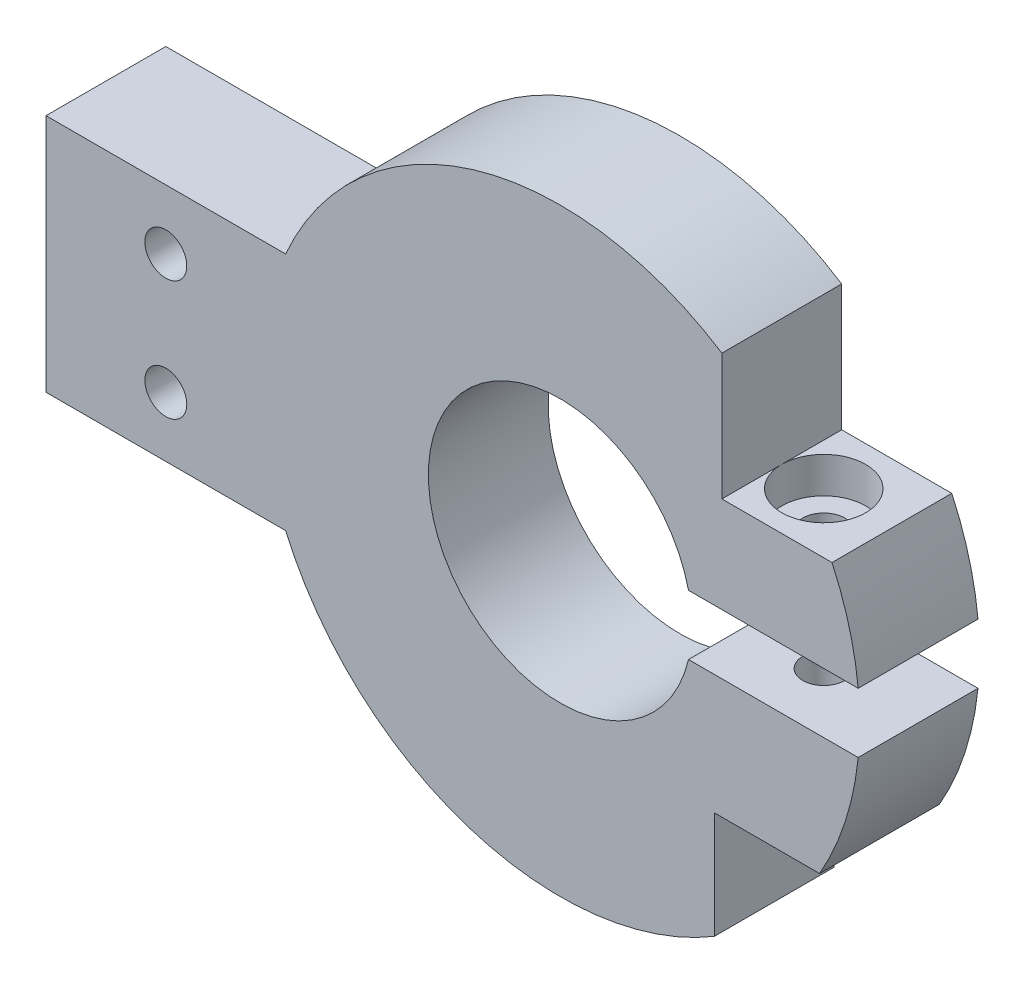
ISO-10303-21;
HEADER;
FILE_DESCRIPTION(('STEP AP214'),'2;1');
FILE_NAME('part.step','',(''),(''),'','','');
FILE_SCHEMA(('AUTOMOTIVE_DESIGN { 1 0 10303 214 1 1 1 1 }'));
ENDSEC;
DATA;
#1=APPLICATION_CONTEXT('core data for automotive mechanical design processes');
#2=APPLICATION_PROTOCOL_DEFINITION('international standard','automotive_design',2000,#1);
#3=PRODUCT_CONTEXT('',#1,'mechanical');
#4=PRODUCT('Part','Part','',(#3));
#5=PRODUCT_RELATED_PRODUCT_CATEGORY('part','',(#4));
#6=PRODUCT_DEFINITION_FORMATION('','',#4);
#7=PRODUCT_DEFINITION_CONTEXT('part definition',#1,'design');
#8=PRODUCT_DEFINITION('design','',#6,#7);
#9=PRODUCT_DEFINITION_SHAPE('','',#8);
#10=(LENGTH_UNIT() NAMED_UNIT(*) SI_UNIT(.MILLI.,.METRE.));
#11=(NAMED_UNIT(*) PLANE_ANGLE_UNIT() SI_UNIT($,.RADIAN.));
#12=(NAMED_UNIT(*) SI_UNIT($,.STERADIAN.) SOLID_ANGLE_UNIT());
#13=UNCERTAINTY_MEASURE_WITH_UNIT(LENGTH_MEASURE(1.E-05),#10,'distance_accuracy_value','');
#14=(GEOMETRIC_REPRESENTATION_CONTEXT(3) GLOBAL_UNCERTAINTY_ASSIGNED_CONTEXT((#13)) GLOBAL_UNIT_ASSIGNED_CONTEXT((#10,
#11,#12)) REPRESENTATION_CONTEXT('',''));
#15=CARTESIAN_POINT('',(0.,0.,0.));
#16=DIRECTION('',(0.,0.,1.));
#17=DIRECTION('',(1.,0.,0.));
#18=AXIS2_PLACEMENT_3D('',#15,#16,#17);
#19=CARTESIAN_POINT('',(-32.9138692452306,-5.,10.));
#20=DIRECTION('',(0.,0.,-1.));
#21=DIRECTION('',(-1.,0.,0.));
#22=AXIS2_PLACEMENT_3D('',#19,#20,#21);
#23=CYLINDRICAL_SURFACE('',#22,1.75);
#24=CARTESIAN_POINT('',(-32.9138692452306,-5.,10.));
#25=DIRECTION('',(0.,0.,-1.));
#26=DIRECTION('',(1.,0.,0.));
#27=AXIS2_PLACEMENT_3D('',#24,#25,#26);
#28=CIRCLE('',#27,1.75);
#29=CARTESIAN_POINT('',(-31.1638692452306,-5.,10.));
#30=VERTEX_POINT('',#29);
#31=EDGE_CURVE('E192',#30,#30,#28,.T.);
#32=ORIENTED_EDGE('',*,*,#31,.F.);
#33=EDGE_LOOP('',(#32));
#34=FACE_BOUND('',#33,.T.);
#35=CARTESIAN_POINT('',(-32.9138692452306,-5.,5.));
#36=DIRECTION('',(0.,0.,-1.));
#37=DIRECTION('',(-1.,0.,0.));
#38=AXIS2_PLACEMENT_3D('',#35,#36,#37);
#39=CIRCLE('',#38,1.75);
#40=CARTESIAN_POINT('',(-34.6638692452306,-5.,5.));
#41=VERTEX_POINT('',#40);
#42=EDGE_CURVE('E37',#41,#41,#39,.F.);
#43=ORIENTED_EDGE('',*,*,#42,.F.);
#44=EDGE_LOOP('',(#43));
#45=FACE_BOUND('',#44,.T.);
#46=ADVANCED_FACE('F33',(#34,#45),#23,.F.);
#47=CARTESIAN_POINT('',(-32.9138692452306,5.,10.));
#48=DIRECTION('',(0.,0.,-1.));
#49=DIRECTION('',(-1.,0.,0.));
#50=AXIS2_PLACEMENT_3D('',#47,#48,#49);
#51=CYLINDRICAL_SURFACE('',#50,1.75);
#52=CARTESIAN_POINT('',(-32.9138692452306,5.,10.));
#53=DIRECTION('',(0.,0.,-1.));
#54=DIRECTION('',(-1.,0.,0.));
#55=AXIS2_PLACEMENT_3D('',#52,#53,#54);
#56=CIRCLE('',#55,1.75);
#57=CARTESIAN_POINT('',(-34.6638692452306,5.,10.));
#58=VERTEX_POINT('',#57);
#59=EDGE_CURVE('E200',#58,#58,#56,.T.);
#60=ORIENTED_EDGE('',*,*,#59,.F.);
#61=EDGE_LOOP('',(#60));
#62=FACE_BOUND('',#61,.T.);
#63=CARTESIAN_POINT('',(-32.9138692452306,5.,5.));
#64=DIRECTION('',(0.,0.,-1.));
#65=DIRECTION('',(-1.,0.,0.));
#66=AXIS2_PLACEMENT_3D('',#63,#64,#65);
#67=CIRCLE('',#66,1.75);
#68=CARTESIAN_POINT('',(-34.6638692452306,5.,5.));
#69=VERTEX_POINT('',#68);
#70=EDGE_CURVE('E345',#69,#69,#67,.F.);
#71=ORIENTED_EDGE('',*,*,#70,.F.);
#72=EDGE_LOOP('',(#71));
#73=FACE_BOUND('',#72,.T.);
#74=ADVANCED_FACE('F425',(#62,#73),#51,.F.);
#75=CARTESIAN_POINT('',(0.,0.,10.));
#76=DIRECTION('',(0.,0.,-1.));
#77=DIRECTION('',(-1.,0.,0.));
#78=AXIS2_PLACEMENT_3D('',#75,#76,#77);
#79=CYLINDRICAL_SURFACE('',#78,25.);
#80=DIRECTION('',(0.,0.,-1.));
#81=VECTOR('',#80,1.);
#82=CARTESIAN_POINT('',(13.5,21.0416254125008,10.));
#83=LINE('',#82,#81);
#84=CARTESIAN_POINT('',(13.5,21.0416254125008,0.));
#85=VERTEX_POINT('',#84);
#86=CARTESIAN_POINT('',(13.5,21.0416254125008,10.));
#87=VERTEX_POINT('',#86);
#88=EDGE_CURVE('E189',#85,#87,#83,.F.);
#89=ORIENTED_EDGE('',*,*,#88,.F.);
#90=CARTESIAN_POINT('',(0.,0.,0.));
#91=DIRECTION('',(0.,0.,1.));
#92=DIRECTION('',(1.,0.,0.));
#93=AXIS2_PLACEMENT_3D('',#90,#91,#92);
#94=CIRCLE('',#93,25.);
#95=CARTESIAN_POINT('',(-22.9138692452306,9.99772955287719,0.));
#96=VERTEX_POINT('',#95);
#97=EDGE_CURVE('E188',#85,#96,#94,.T.);
#98=ORIENTED_EDGE('',*,*,#97,.T.);
#99=DIRECTION('',(0.,0.,-1.));
#100=VECTOR('',#99,1.);
#101=CARTESIAN_POINT('',(-22.9138692452306,9.9977295528772,10.));
#102=LINE('',#101,#100);
#103=CARTESIAN_POINT('',(-22.9138692452306,9.99772955287719,10.));
#104=VERTEX_POINT('',#103);
#105=EDGE_CURVE('E214',#104,#96,#102,.T.);
#106=ORIENTED_EDGE('',*,*,#105,.F.);
#107=CARTESIAN_POINT('',(0.,0.,10.));
#108=DIRECTION('',(0.,0.,1.));
#109=DIRECTION('',(1.,0.,0.));
#110=AXIS2_PLACEMENT_3D('',#107,#108,#109);
#111=CIRCLE('',#110,25.);
#112=EDGE_CURVE('E328',#87,#104,#111,.T.);
#113=ORIENTED_EDGE('',*,*,#112,.F.);
#114=EDGE_LOOP('',(#89,#98,#106,#113));
#115=FACE_BOUND('',#114,.T.);
#116=ADVANCED_FACE('F35',(#115),#79,.T.);
#117=DIRECTION('',(0.,0.,-1.));
#118=VECTOR('',#117,1.);
#119=CARTESIAN_POINT('',(22.6881026090769,10.5,10.));
#120=LINE('',#119,#118);
#121=CARTESIAN_POINT('',(22.6881026090769,10.5,10.));
#122=VERTEX_POINT('',#121);
#123=CARTESIAN_POINT('',(22.6881026090769,10.5,0.));
#124=VERTEX_POINT('',#123);
#125=EDGE_CURVE('E50',#122,#124,#120,.T.);
#126=ORIENTED_EDGE('',*,*,#125,.F.);
#127=CARTESIAN_POINT('',(24.8746859276655,2.5,10.));
#128=VERTEX_POINT('',#127);
#129=EDGE_CURVE('E324',#128,#122,#111,.T.);
#130=ORIENTED_EDGE('',*,*,#129,.F.);
#131=DIRECTION('',(0.,0.,-1.));
#132=VECTOR('',#131,1.);
#133=CARTESIAN_POINT('',(24.8746859276655,2.5,10.));
#134=LINE('',#133,#132);
#135=CARTESIAN_POINT('',(24.8746859276655,2.5,0.));
#136=VERTEX_POINT('',#135);
#137=EDGE_CURVE('E314',#128,#136,#134,.T.);
#138=ORIENTED_EDGE('',*,*,#137,.T.);
#139=EDGE_CURVE('E330',#136,#124,#94,.T.);
#140=ORIENTED_EDGE('',*,*,#139,.T.);
#141=EDGE_LOOP('',(#126,#130,#138,#140));
#142=FACE_BOUND('',#141,.T.);
#143=ADVANCED_FACE('F369',(#142),#79,.T.);
#144=CARTESIAN_POINT('',(0.,0.,10.));
#145=DIRECTION('',(0.,0.,1.));
#146=DIRECTION('',(1.,0.,0.));
#147=AXIS2_PLACEMENT_3D('',#144,#145,#146);
#148=PLANE('',#147);
#149=ORIENTED_EDGE('',*,*,#31,.T.);
#150=EDGE_LOOP('',(#149));
#151=FACE_BOUND('',#150,.T.);
#152=ORIENTED_EDGE('',*,*,#59,.T.);
#153=EDGE_LOOP('',(#152));
#154=FACE_BOUND('',#153,.T.);
#155=DIRECTION('',(-1.,0.,0.));
#156=VECTOR('',#155,1.);
#157=CARTESIAN_POINT('',(0.,10.5,10.));
#158=LINE('',#157,#156);
#159=CARTESIAN_POINT('',(13.5,10.5,10.));
#160=VERTEX_POINT('',#159);
#161=EDGE_CURVE('E195',#122,#160,#158,.T.);
#162=ORIENTED_EDGE('',*,*,#161,.T.);
#163=DIRECTION('',(0.,1.,0.));
#164=VECTOR('',#163,1.);
#165=CARTESIAN_POINT('',(13.5,0.,10.));
#166=LINE('',#165,#164);
#167=EDGE_CURVE('E190',#160,#87,#166,.T.);
#168=ORIENTED_EDGE('',*,*,#167,.T.);
#169=ORIENTED_EDGE('',*,*,#112,.T.);
#170=DIRECTION('',(1.,0.,0.));
#171=VECTOR('',#170,1.);
#172=CARTESIAN_POINT('',(-42.9138692452306,9.9977295528772,10.));
#173=LINE('',#172,#171);
#174=CARTESIAN_POINT('',(-42.9138692452306,9.9977295528772,10.));
#175=VERTEX_POINT('',#174);
#176=EDGE_CURVE('E204',#175,#104,#173,.T.);
#177=ORIENTED_EDGE('',*,*,#176,.F.);
#178=DIRECTION('',(0.,1.,0.));
#179=VECTOR('',#178,1.);
#180=CARTESIAN_POINT('',(-42.9138692452306,-9.99772955287719,10.));
#181=LINE('',#180,#179);
#182=CARTESIAN_POINT('',(-42.9138692452306,-9.99772955287719,10.));
#183=VERTEX_POINT('',#182);
#184=EDGE_CURVE('E211',#183,#175,#181,.T.);
#185=ORIENTED_EDGE('',*,*,#184,.F.);
#186=DIRECTION('',(-1.,0.,0.));
#187=VECTOR('',#186,1.);
#188=CARTESIAN_POINT('',(-22.9138692452306,-9.9977295528772,10.));
#189=LINE('',#188,#187);
#190=CARTESIAN_POINT('',(-22.9138692452306,-9.99772955287719,10.));
#191=VERTEX_POINT('',#190);
#192=EDGE_CURVE('E207',#191,#183,#189,.T.);
#193=ORIENTED_EDGE('',*,*,#192,.F.);
#194=CARTESIAN_POINT('',(12.8667900828572,-21.4346848113913,10.));
#195=VERTEX_POINT('',#194);
#196=EDGE_CURVE('E385',#191,#195,#111,.T.);
#197=ORIENTED_EDGE('',*,*,#196,.T.);
#198=DIRECTION('',(0.,-1.,0.));
#199=VECTOR('',#198,1.);
#200=CARTESIAN_POINT('',(12.8667900828572,0.,10.));
#201=LINE('',#200,#199);
#202=CARTESIAN_POINT('',(12.8667900828572,-12.5,10.));
#203=VERTEX_POINT('',#202);
#204=EDGE_CURVE('E257',#203,#195,#201,.T.);
#205=ORIENTED_EDGE('',*,*,#204,.F.);
#206=DIRECTION('',(1.,0.,0.));
#207=VECTOR('',#206,1.);
#208=CARTESIAN_POINT('',(0.,-12.5,10.));
#209=LINE('',#208,#207);
#210=CARTESIAN_POINT('',(21.650635094611,-12.5,10.));
#211=VERTEX_POINT('',#210);
#212=EDGE_CURVE('E251',#203,#211,#209,.T.);
#213=ORIENTED_EDGE('',*,*,#212,.T.);
#214=CARTESIAN_POINT('',(24.8746859276655,-2.5,10.));
#215=VERTEX_POINT('',#214);
#216=EDGE_CURVE('E329',#211,#215,#111,.T.);
#217=ORIENTED_EDGE('',*,*,#216,.T.);
#218=DIRECTION('',(1.,0.,0.));
#219=VECTOR('',#218,1.);
#220=CARTESIAN_POINT('',(0.,-2.5,10.));
#221=LINE('',#220,#219);
#222=CARTESIAN_POINT('',(10.7121426428143,-2.5,10.));
#223=VERTEX_POINT('',#222);
#224=EDGE_CURVE('E299',#223,#215,#221,.T.);
#225=ORIENTED_EDGE('',*,*,#224,.F.);
#226=CARTESIAN_POINT('',(0.,0.,10.));
#227=DIRECTION('',(0.,0.,1.));
#228=DIRECTION('',(1.,0.,0.));
#229=AXIS2_PLACEMENT_3D('',#226,#227,#228);
#230=CIRCLE('',#229,11.);
#231=CARTESIAN_POINT('',(10.7121426428143,2.5,10.));
#232=VERTEX_POINT('',#231);
#233=EDGE_CURVE('E318',#232,#223,#230,.T.);
#234=ORIENTED_EDGE('',*,*,#233,.F.);
#235=DIRECTION('',(-1.,0.,0.));
#236=VECTOR('',#235,1.);
#237=CARTESIAN_POINT('',(25.,2.5,10.));
#238=LINE('',#237,#236);
#239=EDGE_CURVE('E305',#128,#232,#238,.T.);
#240=ORIENTED_EDGE('',*,*,#239,.F.);
#241=ORIENTED_EDGE('',*,*,#129,.T.);
#242=EDGE_LOOP('',(#162,#168,#169,#177,#185,#193,#197,#205,#213,#217,#225,#234,#240,#241));
#243=FACE_BOUND('',#242,.T.);
#244=ADVANCED_FACE('F364',(#151,#154,#243),#148,.T.);
#245=CARTESIAN_POINT('',(0.,0.,0.));
#246=DIRECTION('',(0.,0.,1.));
#247=DIRECTION('',(1.,0.,0.));
#248=AXIS2_PLACEMENT_3D('',#245,#246,#247);
#249=PLANE('',#248);
#250=CARTESIAN_POINT('',(-32.9138692452306,-5.,0.));
#251=DIRECTION('',(0.,0.,-1.));
#252=DIRECTION('',(-1.,0.,0.));
#253=AXIS2_PLACEMENT_3D('',#250,#251,#252);
#254=CIRCLE('',#253,3.5);
#255=CARTESIAN_POINT('',(-36.4138692452306,-5.,0.));
#256=VERTEX_POINT('',#255);
#257=EDGE_CURVE('E358',#256,#256,#254,.T.);
#258=ORIENTED_EDGE('',*,*,#257,.F.);
#259=EDGE_LOOP('',(#258));
#260=FACE_BOUND('',#259,.T.);
#261=CARTESIAN_POINT('',(-32.9138692452306,5.,0.));
#262=DIRECTION('',(0.,0.,-1.));
#263=DIRECTION('',(-1.,0.,0.));
#264=AXIS2_PLACEMENT_3D('',#261,#262,#263);
#265=CIRCLE('',#264,3.5);
#266=CARTESIAN_POINT('',(-36.4138692452306,5.,0.));
#267=VERTEX_POINT('',#266);
#268=EDGE_CURVE('E351',#267,#267,#265,.T.);
#269=ORIENTED_EDGE('',*,*,#268,.F.);
#270=EDGE_LOOP('',(#269));
#271=FACE_BOUND('',#270,.T.);
#272=DIRECTION('',(0.,1.,0.));
#273=VECTOR('',#272,1.);
#274=CARTESIAN_POINT('',(13.5,0.,0.));
#275=LINE('',#274,#273);
#276=CARTESIAN_POINT('',(13.5,10.5,0.));
#277=VERTEX_POINT('',#276);
#278=EDGE_CURVE('E180',#277,#85,#275,.T.);
#279=ORIENTED_EDGE('',*,*,#278,.F.);
#280=DIRECTION('',(-1.,0.,0.));
#281=VECTOR('',#280,1.);
#282=CARTESIAN_POINT('',(0.,10.5,0.));
#283=LINE('',#282,#281);
#284=EDGE_CURVE('E171',#124,#277,#283,.T.);
#285=ORIENTED_EDGE('',*,*,#284,.F.);
#286=ORIENTED_EDGE('',*,*,#139,.F.);
#287=DIRECTION('',(-1.,0.,0.));
#288=VECTOR('',#287,1.);
#289=CARTESIAN_POINT('',(25.,2.5,0.));
#290=LINE('',#289,#288);
#291=CARTESIAN_POINT('',(10.7121426428143,2.5,0.));
#292=VERTEX_POINT('',#291);
#293=EDGE_CURVE('E304',#136,#292,#290,.T.);
#294=ORIENTED_EDGE('',*,*,#293,.T.);
#295=CARTESIAN_POINT('',(0.,0.,0.));
#296=DIRECTION('',(0.,0.,1.));
#297=DIRECTION('',(1.,0.,0.));
#298=AXIS2_PLACEMENT_3D('',#295,#296,#297);
#299=CIRCLE('',#298,11.);
#300=CARTESIAN_POINT('',(10.7121426428143,-2.5,0.));
#301=VERTEX_POINT('',#300);
#302=EDGE_CURVE('E317',#292,#301,#299,.T.);
#303=ORIENTED_EDGE('',*,*,#302,.T.);
#304=DIRECTION('',(1.,0.,0.));
#305=VECTOR('',#304,1.);
#306=CARTESIAN_POINT('',(0.,-2.5,0.));
#307=LINE('',#306,#305);
#308=CARTESIAN_POINT('',(24.8746859276655,-2.5,0.));
#309=VERTEX_POINT('',#308);
#310=EDGE_CURVE('E301',#301,#309,#307,.T.);
#311=ORIENTED_EDGE('',*,*,#310,.T.);
#312=CARTESIAN_POINT('',(21.650635094611,-12.5,0.));
#313=VERTEX_POINT('',#312);
#314=EDGE_CURVE('E321',#313,#309,#94,.T.);
#315=ORIENTED_EDGE('',*,*,#314,.F.);
#316=DIRECTION('',(1.,0.,0.));
#317=VECTOR('',#316,1.);
#318=CARTESIAN_POINT('',(0.,-12.5,0.));
#319=LINE('',#318,#317);
#320=CARTESIAN_POINT('',(12.8667900828572,-12.5,0.));
#321=VERTEX_POINT('',#320);
#322=EDGE_CURVE('E247',#321,#313,#319,.T.);
#323=ORIENTED_EDGE('',*,*,#322,.F.);
#324=DIRECTION('',(0.,-1.,0.));
#325=VECTOR('',#324,1.);
#326=CARTESIAN_POINT('',(12.8667900828572,0.,0.));
#327=LINE('',#326,#325);
#328=CARTESIAN_POINT('',(12.8667900828572,-21.4346848113913,0.));
#329=VERTEX_POINT('',#328);
#330=EDGE_CURVE('E42',#321,#329,#327,.T.);
#331=ORIENTED_EDGE('',*,*,#330,.T.);
#332=CARTESIAN_POINT('',(-22.9138692452306,-9.9977295528772,0.));
#333=VERTEX_POINT('',#332);
#334=EDGE_CURVE('E403',#333,#329,#94,.T.);
#335=ORIENTED_EDGE('',*,*,#334,.F.);
#336=DIRECTION('',(-1.,0.,0.));
#337=VECTOR('',#336,1.);
#338=CARTESIAN_POINT('',(-22.9138692452306,-9.9977295528772,0.));
#339=LINE('',#338,#337);
#340=CARTESIAN_POINT('',(-42.9138692452306,-9.99772955287719,0.));
#341=VERTEX_POINT('',#340);
#342=EDGE_CURVE('E216',#333,#341,#339,.T.);
#343=ORIENTED_EDGE('',*,*,#342,.T.);
#344=DIRECTION('',(0.,1.,0.));
#345=VECTOR('',#344,1.);
#346=CARTESIAN_POINT('',(-42.9138692452306,-9.99772955287719,0.));
#347=LINE('',#346,#345);
#348=CARTESIAN_POINT('',(-42.9138692452306,9.9977295528772,0.));
#349=VERTEX_POINT('',#348);
#350=EDGE_CURVE('E208',#341,#349,#347,.T.);
#351=ORIENTED_EDGE('',*,*,#350,.T.);
#352=DIRECTION('',(1.,0.,0.));
#353=VECTOR('',#352,1.);
#354=CARTESIAN_POINT('',(-42.9138692452306,9.9977295528772,0.));
#355=LINE('',#354,#353);
#356=EDGE_CURVE('E203',#349,#96,#355,.T.);
#357=ORIENTED_EDGE('',*,*,#356,.T.);
#358=ORIENTED_EDGE('',*,*,#97,.F.);
#359=EDGE_LOOP('',(#279,#285,#286,#294,#303,#311,#315,#323,#331,#335,#343,#351,#357,#358));
#360=FACE_BOUND('',#359,.T.);
#361=ADVANCED_FACE('F186',(#260,#271,#360),#249,.F.);
#362=CARTESIAN_POINT('',(17.,7.49999999999999,5.));
#363=DIRECTION('',(0.,1.,0.));
#364=DIRECTION('',(0.,0.,1.));
#365=AXIS2_PLACEMENT_3D('',#362,#363,#364);
#366=CYLINDRICAL_SURFACE('',#365,3.5);
#367=CARTESIAN_POINT('',(17.,7.49999999999999,5.));
#368=DIRECTION('',(0.,1.,0.));
#369=DIRECTION('',(0.,0.,1.));
#370=AXIS2_PLACEMENT_3D('',#367,#368,#369);
#371=CIRCLE('',#370,3.5);
#372=CARTESIAN_POINT('',(17.,7.49999999999999,8.5));
#373=VERTEX_POINT('',#372);
#374=EDGE_CURVE('E292',#373,#373,#371,.T.);
#375=ORIENTED_EDGE('',*,*,#374,.F.);
#376=EDGE_LOOP('',(#375));
#377=FACE_BOUND('',#376,.T.);
#378=CARTESIAN_POINT('',(17.,10.5,5.));
#379=DIRECTION('',(0.,1.,0.));
#380=DIRECTION('',(0.,0.,1.));
#381=AXIS2_PLACEMENT_3D('',#378,#379,#380);
#382=CIRCLE('',#381,3.5);
#383=CARTESIAN_POINT('',(13.5,10.5,5.));
#384=VERTEX_POINT('',#383);
#385=EDGE_CURVE('E11',#384,#384,#382,.F.);
#386=ORIENTED_EDGE('',*,*,#385,.F.);
#387=EDGE_LOOP('',(#386));
#388=FACE_BOUND('',#387,.T.);
#389=ADVANCED_FACE('F423',(#377,#388),#366,.F.);
#390=ORIENTED_EDGE('',*,*,#196,.F.);
#391=DIRECTION('',(0.,0.,-1.));
#392=VECTOR('',#391,1.);
#393=CARTESIAN_POINT('',(-22.9138692452306,-9.9977295528772,10.));
#394=LINE('',#393,#392);
#395=EDGE_CURVE('E226',#191,#333,#394,.T.);
#396=ORIENTED_EDGE('',*,*,#395,.T.);
#397=ORIENTED_EDGE('',*,*,#334,.T.);
#398=DIRECTION('',(0.,0.,-1.));
#399=VECTOR('',#398,1.);
#400=CARTESIAN_POINT('',(12.8667900828572,-21.4346848113913,10.));
#401=LINE('',#400,#399);
#402=EDGE_CURVE('E254',#329,#195,#401,.F.);
#403=ORIENTED_EDGE('',*,*,#402,.T.);
#404=EDGE_LOOP('',(#390,#396,#397,#403));
#405=FACE_BOUND('',#404,.T.);
#406=ADVANCED_FACE('F402',(#405),#79,.T.);
#407=DIRECTION('',(0.,0.,-1.));
#408=VECTOR('',#407,1.);
#409=CARTESIAN_POINT('',(21.650635094611,-12.5,10.));
#410=LINE('',#409,#408);
#411=EDGE_CURVE('E249',#313,#211,#410,.F.);
#412=ORIENTED_EDGE('',*,*,#411,.F.);
#413=ORIENTED_EDGE('',*,*,#314,.T.);
#414=DIRECTION('',(0.,0.,-1.));
#415=VECTOR('',#414,1.);
#416=CARTESIAN_POINT('',(24.8746859276655,-2.5,10.));
#417=LINE('',#416,#415);
#418=EDGE_CURVE('E308',#309,#215,#417,.F.);
#419=ORIENTED_EDGE('',*,*,#418,.T.);
#420=ORIENTED_EDGE('',*,*,#216,.F.);
#421=EDGE_LOOP('',(#412,#413,#419,#420));
#422=FACE_BOUND('',#421,.T.);
#423=ADVANCED_FACE('F413',(#422),#79,.T.);
#424=CARTESIAN_POINT('',(19.0207259421637,-7.49999999999998,8.5));
#425=DIRECTION('',(-0.866025403784439,0.,-0.5));
#426=DIRECTION('',(-0.5,0.,0.866025403784439));
#427=AXIS2_PLACEMENT_3D('',#424,#425,#426);
#428=PLANE('',#427);
#429=DIRECTION('',(0.,-1.,0.));
#430=VECTOR('',#429,1.);
#431=CARTESIAN_POINT('',(21.0414518843274,-7.49999999999998,5.));
#432=LINE('',#431,#430);
#433=CARTESIAN_POINT('',(21.0414518843274,-7.49999999999998,5.));
#434=VERTEX_POINT('',#433);
#435=CARTESIAN_POINT('',(21.0414518843274,-12.5,5.));
#436=VERTEX_POINT('',#435);
#437=EDGE_CURVE('E288',#434,#436,#432,.T.);
#438=ORIENTED_EDGE('',*,*,#437,.T.);
#439=DIRECTION('',(-0.5,0.,0.866025403784439));
#440=VECTOR('',#439,1.);
#441=CARTESIAN_POINT('',(19.0207259421637,-12.5,8.5));
#442=LINE('',#441,#440);
#443=CARTESIAN_POINT('',(19.0207259421637,-12.5,8.5));
#444=VERTEX_POINT('',#443);
#445=EDGE_CURVE('E244',#436,#444,#442,.T.);
#446=ORIENTED_EDGE('',*,*,#445,.T.);
#447=DIRECTION('',(0.,-1.,0.));
#448=VECTOR('',#447,1.);
#449=CARTESIAN_POINT('',(19.0207259421637,-7.49999999999998,8.5));
#450=LINE('',#449,#448);
#451=CARTESIAN_POINT('',(19.0207259421637,-7.49999999999998,8.5));
#452=VERTEX_POINT('',#451);
#453=EDGE_CURVE('E273',#452,#444,#450,.T.);
#454=ORIENTED_EDGE('',*,*,#453,.F.);
#455=DIRECTION('',(0.5,0.,-0.866025403784439));
#456=VECTOR('',#455,1.);
#457=CARTESIAN_POINT('',(19.0207259421637,-7.49999999999998,8.5));
#458=LINE('',#457,#456);
#459=EDGE_CURVE('E260',#452,#434,#458,.T.);
#460=ORIENTED_EDGE('',*,*,#459,.T.);
#461=EDGE_LOOP('',(#438,#446,#454,#460));
#462=FACE_BOUND('',#461,.T.);
#463=ADVANCED_FACE('F415',(#462),#428,.T.);
#464=CARTESIAN_POINT('',(21.0414518843274,-7.49999999999998,5.));
#465=DIRECTION('',(-0.866025403784439,0.,0.5));
#466=DIRECTION('',(0.5,0.,0.866025403784439));
#467=AXIS2_PLACEMENT_3D('',#464,#465,#466);
#468=PLANE('',#467);
#469=DIRECTION('',(0.,-1.,0.));
#470=VECTOR('',#469,1.);
#471=CARTESIAN_POINT('',(19.0207259421637,-7.49999999999998,1.5));
#472=LINE('',#471,#470);
#473=CARTESIAN_POINT('',(19.0207259421637,-7.49999999999998,1.5));
#474=VERTEX_POINT('',#473);
#475=CARTESIAN_POINT('',(19.0207259421637,-12.5,1.5));
#476=VERTEX_POINT('',#475);
#477=EDGE_CURVE('E285',#474,#476,#472,.T.);
#478=ORIENTED_EDGE('',*,*,#477,.T.);
#479=DIRECTION('',(0.5,0.,0.866025403784439));
#480=VECTOR('',#479,1.);
#481=CARTESIAN_POINT('',(21.0414518843274,-12.5,5.));
#482=LINE('',#481,#480);
#483=EDGE_CURVE('E241',#476,#436,#482,.T.);
#484=ORIENTED_EDGE('',*,*,#483,.T.);
#485=ORIENTED_EDGE('',*,*,#437,.F.);
#486=DIRECTION('',(-0.5,0.,-0.866025403784439));
#487=VECTOR('',#486,1.);
#488=CARTESIAN_POINT('',(21.0414518843274,-7.49999999999998,5.));
#489=LINE('',#488,#487);
#490=EDGE_CURVE('E263',#434,#474,#489,.T.);
#491=ORIENTED_EDGE('',*,*,#490,.T.);
#492=EDGE_LOOP('',(#478,#484,#485,#491));
#493=FACE_BOUND('',#492,.T.);
#494=ADVANCED_FACE('F420',(#493),#468,.T.);
#495=CARTESIAN_POINT('',(19.0207259421637,-7.49999999999998,1.5));
#496=DIRECTION('',(0.,0.,1.));
#497=DIRECTION('',(1.,0.,0.));
#498=AXIS2_PLACEMENT_3D('',#495,#496,#497);
#499=PLANE('',#498);
#500=DIRECTION('',(0.,-1.,0.));
#501=VECTOR('',#500,1.);
#502=CARTESIAN_POINT('',(14.9792740578363,-7.49999999999998,1.5));
#503=LINE('',#502,#501);
#504=CARTESIAN_POINT('',(14.9792740578363,-7.49999999999998,1.5));
#505=VERTEX_POINT('',#504);
#506=CARTESIAN_POINT('',(14.9792740578363,-12.5,1.5));
#507=VERTEX_POINT('',#506);
#508=EDGE_CURVE('E282',#505,#507,#503,.T.);
#509=ORIENTED_EDGE('',*,*,#508,.T.);
#510=DIRECTION('',(1.,0.,0.));
#511=VECTOR('',#510,1.);
#512=CARTESIAN_POINT('',(19.0207259421637,-12.5,1.5));
#513=LINE('',#512,#511);
#514=EDGE_CURVE('E238',#507,#476,#513,.T.);
#515=ORIENTED_EDGE('',*,*,#514,.T.);
#516=ORIENTED_EDGE('',*,*,#477,.F.);
#517=DIRECTION('',(-1.,0.,0.));
#518=VECTOR('',#517,1.);
#519=CARTESIAN_POINT('',(19.0207259421637,-7.49999999999998,1.5));
#520=LINE('',#519,#518);
#521=EDGE_CURVE('E265',#474,#505,#520,.T.);
#522=ORIENTED_EDGE('',*,*,#521,.T.);
#523=EDGE_LOOP('',(#509,#515,#516,#522));
#524=FACE_BOUND('',#523,.T.);
#525=ADVANCED_FACE('F467',(#524),#499,.T.);
#526=CARTESIAN_POINT('',(14.9792740578363,-7.49999999999998,1.5));
#527=DIRECTION('',(0.866025403784438,0.,0.5));
#528=DIRECTION('',(0.5,0.,-0.866025403784438));
#529=AXIS2_PLACEMENT_3D('',#526,#527,#528);
#530=PLANE('',#529);
#531=DIRECTION('',(0.,-1.,0.));
#532=VECTOR('',#531,1.);
#533=CARTESIAN_POINT('',(12.9585481156726,-7.49999999999998,5.));
#534=LINE('',#533,#532);
#535=CARTESIAN_POINT('',(12.9585481156726,-7.49999999999998,5.));
#536=VERTEX_POINT('',#535);
#537=CARTESIAN_POINT('',(12.9585481156726,-12.5,5.));
#538=VERTEX_POINT('',#537);
#539=EDGE_CURVE('E279',#536,#538,#534,.T.);
#540=ORIENTED_EDGE('',*,*,#539,.T.);
#541=DIRECTION('',(0.5,0.,-0.866025403784438));
#542=VECTOR('',#541,1.);
#543=CARTESIAN_POINT('',(14.9792740578363,-12.5,1.5));
#544=LINE('',#543,#542);
#545=EDGE_CURVE('E235',#538,#507,#544,.T.);
#546=ORIENTED_EDGE('',*,*,#545,.T.);
#547=ORIENTED_EDGE('',*,*,#508,.F.);
#548=DIRECTION('',(-0.5,0.,0.866025403784438));
#549=VECTOR('',#548,1.);
#550=CARTESIAN_POINT('',(14.9792740578363,-7.49999999999998,1.5));
#551=LINE('',#550,#549);
#552=EDGE_CURVE('E267',#505,#536,#551,.T.);
#553=ORIENTED_EDGE('',*,*,#552,.T.);
#554=EDGE_LOOP('',(#540,#546,#547,#553));
#555=FACE_BOUND('',#554,.T.);
#556=ADVANCED_FACE('F463',(#555),#530,.T.);
#557=CARTESIAN_POINT('',(12.9585481156726,-7.49999999999998,5.));
#558=DIRECTION('',(0.866025403784439,0.,-0.5));
#559=DIRECTION('',(-0.5,0.,-0.866025403784439));
#560=AXIS2_PLACEMENT_3D('',#557,#558,#559);
#561=PLANE('',#560);
#562=DIRECTION('',(0.,-1.,0.));
#563=VECTOR('',#562,1.);
#564=CARTESIAN_POINT('',(14.9792740578363,-7.49999999999998,8.5));
#565=LINE('',#564,#563);
#566=CARTESIAN_POINT('',(14.9792740578363,-7.49999999999998,8.5));
#567=VERTEX_POINT('',#566);
#568=CARTESIAN_POINT('',(14.9792740578363,-12.5,8.5));
#569=VERTEX_POINT('',#568);
#570=EDGE_CURVE('E276',#567,#569,#565,.T.);
#571=ORIENTED_EDGE('',*,*,#570,.T.);
#572=DIRECTION('',(-0.5,0.,-0.866025403784439));
#573=VECTOR('',#572,1.);
#574=CARTESIAN_POINT('',(12.9585481156726,-12.5,5.));
#575=LINE('',#574,#573);
#576=EDGE_CURVE('E232',#569,#538,#575,.T.);
#577=ORIENTED_EDGE('',*,*,#576,.T.);
#578=ORIENTED_EDGE('',*,*,#539,.F.);
#579=DIRECTION('',(0.5,0.,0.866025403784439));
#580=VECTOR('',#579,1.);
#581=CARTESIAN_POINT('',(12.9585481156726,-7.49999999999998,5.));
#582=LINE('',#581,#580);
#583=EDGE_CURVE('E269',#536,#567,#582,.T.);
#584=ORIENTED_EDGE('',*,*,#583,.T.);
#585=EDGE_LOOP('',(#571,#577,#578,#584));
#586=FACE_BOUND('',#585,.T.);
#587=ADVANCED_FACE('F459',(#586),#561,.T.);
#588=CARTESIAN_POINT('',(14.9792740578363,-7.49999999999998,8.5));
#589=DIRECTION('',(0.,0.,-1.));
#590=DIRECTION('',(-1.,0.,0.));
#591=AXIS2_PLACEMENT_3D('',#588,#589,#590);
#592=PLANE('',#591);
#593=ORIENTED_EDGE('',*,*,#453,.T.);
#594=DIRECTION('',(-1.,0.,0.));
#595=VECTOR('',#594,1.);
#596=CARTESIAN_POINT('',(14.9792740578363,-12.5,8.5));
#597=LINE('',#596,#595);
#598=EDGE_CURVE('E335',#444,#569,#597,.T.);
#599=ORIENTED_EDGE('',*,*,#598,.T.);
#600=ORIENTED_EDGE('',*,*,#570,.F.);
#601=DIRECTION('',(1.,0.,0.));
#602=VECTOR('',#601,1.);
#603=CARTESIAN_POINT('',(14.9792740578363,-7.49999999999998,8.5));
#604=LINE('',#603,#602);
#605=EDGE_CURVE('E271',#567,#452,#604,.T.);
#606=ORIENTED_EDGE('',*,*,#605,.T.);
#607=EDGE_LOOP('',(#593,#599,#600,#606));
#608=FACE_BOUND('',#607,.T.);
#609=ADVANCED_FACE('F455',(#608),#592,.T.);
#610=CARTESIAN_POINT('',(17.,-25.,5.));
#611=DIRECTION('',(0.,1.,0.));
#612=DIRECTION('',(0.,0.,1.));
#613=AXIS2_PLACEMENT_3D('',#610,#611,#612);
#614=CYLINDRICAL_SURFACE('',#613,1.75);
#615=CARTESIAN_POINT('',(17.,2.5,5.));
#616=DIRECTION('',(0.,1.,0.));
#617=DIRECTION('',(-1.,0.,0.));
#618=AXIS2_PLACEMENT_3D('',#615,#616,#617);
#619=CIRCLE('',#618,1.75);
#620=CARTESIAN_POINT('',(15.25,2.5,5.));
#621=VERTEX_POINT('',#620);
#622=EDGE_CURVE('E300',#621,#621,#619,.T.);
#623=ORIENTED_EDGE('',*,*,#622,.F.);
#624=EDGE_LOOP('',(#623));
#625=FACE_BOUND('',#624,.T.);
#626=CARTESIAN_POINT('',(17.,7.49999999999999,5.));
#627=DIRECTION('',(0.,1.,0.));
#628=DIRECTION('',(0.,0.,1.));
#629=AXIS2_PLACEMENT_3D('',#626,#627,#628);
#630=CIRCLE('',#629,1.75);
#631=CARTESIAN_POINT('',(17.,7.49999999999999,6.75));
#632=VERTEX_POINT('',#631);
#633=EDGE_CURVE('E295',#632,#632,#630,.F.);
#634=ORIENTED_EDGE('',*,*,#633,.F.);
#635=EDGE_LOOP('',(#634));
#636=FACE_BOUND('',#635,.T.);
#637=ADVANCED_FACE('F458',(#625,#636),#614,.F.);
#638=CARTESIAN_POINT('',(0.,0.,10.));
#639=DIRECTION('',(0.,0.,-1.));
#640=DIRECTION('',(-1.,0.,0.));
#641=AXIS2_PLACEMENT_3D('',#638,#639,#640);
#642=CYLINDRICAL_SURFACE('',#641,11.);
#643=DIRECTION('',(0.,0.,-1.));
#644=VECTOR('',#643,1.);
#645=CARTESIAN_POINT('',(10.7121426428143,2.5,10.));
#646=LINE('',#645,#644);
#647=EDGE_CURVE('E333',#232,#292,#646,.T.);
#648=ORIENTED_EDGE('',*,*,#647,.F.);
#649=ORIENTED_EDGE('',*,*,#233,.T.);
#650=DIRECTION('',(0.,0.,-1.));
#651=VECTOR('',#650,1.);
#652=CARTESIAN_POINT('',(10.7121426428143,-2.5,10.));
#653=LINE('',#652,#651);
#654=EDGE_CURVE('E327',#301,#223,#653,.F.);
#655=ORIENTED_EDGE('',*,*,#654,.F.);
#656=ORIENTED_EDGE('',*,*,#302,.F.);
#657=EDGE_LOOP('',(#648,#649,#655,#656));
#658=FACE_BOUND('',#657,.T.);
#659=ADVANCED_FACE('F375',(#658),#642,.F.);
#660=CARTESIAN_POINT('',(0.,-2.5,0.));
#661=DIRECTION('',(0.,-1.,0.));
#662=DIRECTION('',(0.,0.,-1.));
#663=AXIS2_PLACEMENT_3D('',#660,#661,#662);
#664=PLANE('',#663);
#665=CARTESIAN_POINT('',(17.,-2.5,5.));
#666=DIRECTION('',(0.,-1.,0.));
#667=DIRECTION('',(0.,0.,-1.));
#668=AXIS2_PLACEMENT_3D('',#665,#666,#667);
#669=CIRCLE('',#668,1.75);
#670=CARTESIAN_POINT('',(17.,-2.5,3.25));
#671=VERTEX_POINT('',#670);
#672=EDGE_CURVE('E296',#671,#671,#669,.T.);
#673=ORIENTED_EDGE('',*,*,#672,.T.);
#674=EDGE_LOOP('',(#673));
#675=FACE_BOUND('',#674,.T.);
#676=ORIENTED_EDGE('',*,*,#310,.F.);
#677=ORIENTED_EDGE('',*,*,#654,.T.);
#678=ORIENTED_EDGE('',*,*,#224,.T.);
#679=ORIENTED_EDGE('',*,*,#418,.F.);
#680=EDGE_LOOP('',(#676,#677,#678,#679));
#681=FACE_BOUND('',#680,.T.);
#682=ADVANCED_FACE('F379',(#675,#681),#664,.F.);
#683=CARTESIAN_POINT('',(25.,2.5,0.));
#684=DIRECTION('',(0.,1.,0.));
#685=DIRECTION('',(-1.,0.,0.));
#686=AXIS2_PLACEMENT_3D('',#683,#684,#685);
#687=PLANE('',#686);
#688=ORIENTED_EDGE('',*,*,#622,.T.);
#689=EDGE_LOOP('',(#688));
#690=FACE_BOUND('',#689,.T.);
#691=ORIENTED_EDGE('',*,*,#239,.T.);
#692=ORIENTED_EDGE('',*,*,#647,.T.);
#693=ORIENTED_EDGE('',*,*,#293,.F.);
#694=ORIENTED_EDGE('',*,*,#137,.F.);
#695=EDGE_LOOP('',(#691,#692,#693,#694));
#696=FACE_BOUND('',#695,.T.);
#697=ADVANCED_FACE('F484',(#690,#696),#687,.F.);
#698=CARTESIAN_POINT('',(17.,-7.49999999999998,5.));
#699=DIRECTION('',(0.,1.,0.));
#700=DIRECTION('',(0.,0.,1.));
#701=AXIS2_PLACEMENT_3D('',#698,#699,#700);
#702=CIRCLE('',#701,1.75);
#703=CARTESIAN_POINT('',(17.,-7.49999999999998,6.75));
#704=VERTEX_POINT('',#703);
#705=EDGE_CURVE('E291',#704,#704,#702,.F.);
#706=ORIENTED_EDGE('',*,*,#705,.T.);
#707=EDGE_LOOP('',(#706));
#708=FACE_BOUND('',#707,.T.);
#709=ORIENTED_EDGE('',*,*,#672,.F.);
#710=EDGE_LOOP('',(#709));
#711=FACE_BOUND('',#710,.T.);
#712=ADVANCED_FACE('F477',(#708,#711),#614,.F.);
#713=CARTESIAN_POINT('',(17.,7.49999999999999,5.));
#714=DIRECTION('',(0.,1.,0.));
#715=DIRECTION('',(0.,0.,1.));
#716=AXIS2_PLACEMENT_3D('',#713,#714,#715);
#717=PLANE('',#716);
#718=ORIENTED_EDGE('',*,*,#374,.T.);
#719=EDGE_LOOP('',(#718));
#720=FACE_BOUND('',#719,.T.);
#721=ORIENTED_EDGE('',*,*,#633,.T.);
#722=EDGE_LOOP('',(#721));
#723=FACE_BOUND('',#722,.T.);
#724=ADVANCED_FACE('F453',(#720,#723),#717,.T.);
#725=CARTESIAN_POINT('',(0.,-7.49999999999998,0.));
#726=DIRECTION('',(0.,1.,0.));
#727=DIRECTION('',(0.,0.,1.));
#728=AXIS2_PLACEMENT_3D('',#725,#726,#727);
#729=PLANE('',#728);
#730=ORIENTED_EDGE('',*,*,#459,.F.);
#731=ORIENTED_EDGE('',*,*,#605,.F.);
#732=ORIENTED_EDGE('',*,*,#583,.F.);
#733=ORIENTED_EDGE('',*,*,#552,.F.);
#734=ORIENTED_EDGE('',*,*,#521,.F.);
#735=ORIENTED_EDGE('',*,*,#490,.F.);
#736=EDGE_LOOP('',(#730,#731,#732,#733,#734,#735));
#737=FACE_BOUND('',#736,.T.);
#738=ORIENTED_EDGE('',*,*,#705,.F.);
#739=EDGE_LOOP('',(#738));
#740=FACE_BOUND('',#739,.T.);
#741=ADVANCED_FACE('F450',(#737,#740),#729,.F.);
#742=CARTESIAN_POINT('',(12.8667900828572,-12.5,5.));
#743=DIRECTION('',(-1.,0.,0.));
#744=DIRECTION('',(0.,0.,1.));
#745=AXIS2_PLACEMENT_3D('',#742,#743,#744);
#746=PLANE('',#745);
#747=ORIENTED_EDGE('',*,*,#204,.T.);
#748=ORIENTED_EDGE('',*,*,#402,.F.);
#749=ORIENTED_EDGE('',*,*,#330,.F.);
#750=DIRECTION('',(0.,0.,-1.));
#751=VECTOR('',#750,1.);
#752=CARTESIAN_POINT('',(12.8667900828572,-12.5,14.6172900249083));
#753=LINE('',#752,#751);
#754=EDGE_CURVE('E223',#203,#321,#753,.T.);
#755=ORIENTED_EDGE('',*,*,#754,.F.);
#756=EDGE_LOOP('',(#747,#748,#749,#755));
#757=FACE_BOUND('',#756,.T.);
#758=ADVANCED_FACE('F407',(#757),#746,.F.);
#759=CARTESIAN_POINT('',(0.,-12.5,0.));
#760=DIRECTION('',(0.,-1.,0.));
#761=DIRECTION('',(0.,0.,-1.));
#762=AXIS2_PLACEMENT_3D('',#759,#760,#761);
#763=PLANE('',#762);
#764=ORIENTED_EDGE('',*,*,#483,.F.);
#765=ORIENTED_EDGE('',*,*,#514,.F.);
#766=ORIENTED_EDGE('',*,*,#545,.F.);
#767=ORIENTED_EDGE('',*,*,#576,.F.);
#768=ORIENTED_EDGE('',*,*,#598,.F.);
#769=ORIENTED_EDGE('',*,*,#445,.F.);
#770=EDGE_LOOP('',(#764,#765,#766,#767,#768,#769));
#771=FACE_BOUND('',#770,.T.);
#772=ORIENTED_EDGE('',*,*,#754,.T.);
#773=ORIENTED_EDGE('',*,*,#322,.T.);
#774=ORIENTED_EDGE('',*,*,#411,.T.);
#775=ORIENTED_EDGE('',*,*,#212,.F.);
#776=EDGE_LOOP('',(#772,#773,#774,#775));
#777=FACE_BOUND('',#776,.T.);
#778=ADVANCED_FACE('F412',(#771,#777),#763,.T.);
#779=CARTESIAN_POINT('',(-42.9138692452306,9.9977295528772,10.));
#780=DIRECTION('',(0.,1.,0.));
#781=DIRECTION('',(-1.,0.,0.));
#782=AXIS2_PLACEMENT_3D('',#779,#780,#781);
#783=PLANE('',#782);
#784=ORIENTED_EDGE('',*,*,#356,.F.);
#785=DIRECTION('',(0.,0.,-1.));
#786=VECTOR('',#785,1.);
#787=CARTESIAN_POINT('',(-42.9138692452306,9.9977295528772,10.));
#788=LINE('',#787,#786);
#789=EDGE_CURVE('E221',#175,#349,#788,.T.);
#790=ORIENTED_EDGE('',*,*,#789,.F.);
#791=ORIENTED_EDGE('',*,*,#176,.T.);
#792=ORIENTED_EDGE('',*,*,#105,.T.);
#793=EDGE_LOOP('',(#784,#790,#791,#792));
#794=FACE_BOUND('',#793,.T.);
#795=ADVANCED_FACE('F393',(#794),#783,.T.);
#796=CARTESIAN_POINT('',(-42.9138692452306,-9.99772955287719,10.));
#797=DIRECTION('',(-1.,0.,0.));
#798=DIRECTION('',(0.,0.,1.));
#799=AXIS2_PLACEMENT_3D('',#796,#797,#798);
#800=PLANE('',#799);
#801=ORIENTED_EDGE('',*,*,#350,.F.);
#802=DIRECTION('',(0.,0.,-1.));
#803=VECTOR('',#802,1.);
#804=CARTESIAN_POINT('',(-42.9138692452306,-9.99772955287719,10.));
#805=LINE('',#804,#803);
#806=EDGE_CURVE('E224',#183,#341,#805,.T.);
#807=ORIENTED_EDGE('',*,*,#806,.F.);
#808=ORIENTED_EDGE('',*,*,#184,.T.);
#809=ORIENTED_EDGE('',*,*,#789,.T.);
#810=EDGE_LOOP('',(#801,#807,#808,#809));
#811=FACE_BOUND('',#810,.T.);
#812=ADVANCED_FACE('F396',(#811),#800,.T.);
#813=CARTESIAN_POINT('',(-22.9138692452306,-9.9977295528772,10.));
#814=DIRECTION('',(0.,-1.,0.));
#815=DIRECTION('',(1.,0.,0.));
#816=AXIS2_PLACEMENT_3D('',#813,#814,#815);
#817=PLANE('',#816);
#818=ORIENTED_EDGE('',*,*,#342,.F.);
#819=ORIENTED_EDGE('',*,*,#395,.F.);
#820=ORIENTED_EDGE('',*,*,#192,.T.);
#821=ORIENTED_EDGE('',*,*,#806,.T.);
#822=EDGE_LOOP('',(#818,#819,#820,#821));
#823=FACE_BOUND('',#822,.T.);
#824=ADVANCED_FACE('F400',(#823),#817,.T.);
#825=CARTESIAN_POINT('',(13.5,28.5,5.));
#826=DIRECTION('',(1.,0.,0.));
#827=DIRECTION('',(0.,0.,-1.));
#828=AXIS2_PLACEMENT_3D('',#825,#826,#827);
#829=PLANE('',#828);
#830=ORIENTED_EDGE('',*,*,#88,.T.);
#831=ORIENTED_EDGE('',*,*,#167,.F.);
#832=DIRECTION('',(0.,0.,1.));
#833=VECTOR('',#832,1.);
#834=CARTESIAN_POINT('',(13.5,10.5,-2.17973043269074));
#835=LINE('',#834,#833);
#836=EDGE_CURVE('E183',#384,#160,#835,.T.);
#837=ORIENTED_EDGE('',*,*,#836,.F.);
#838=EDGE_CURVE('E55',#277,#384,#835,.T.);
#839=ORIENTED_EDGE('',*,*,#838,.F.);
#840=ORIENTED_EDGE('',*,*,#278,.T.);
#841=EDGE_LOOP('',(#830,#831,#837,#839,#840));
#842=FACE_BOUND('',#841,.T.);
#843=ADVANCED_FACE('F179',(#842),#829,.T.);
#844=CARTESIAN_POINT('',(0.,10.5,0.));
#845=DIRECTION('',(0.,1.,0.));
#846=DIRECTION('',(0.,0.,1.));
#847=AXIS2_PLACEMENT_3D('',#844,#845,#846);
#848=PLANE('',#847);
#849=ORIENTED_EDGE('',*,*,#125,.T.);
#850=ORIENTED_EDGE('',*,*,#284,.T.);
#851=ORIENTED_EDGE('',*,*,#838,.T.);
#852=ORIENTED_EDGE('',*,*,#385,.T.);
#853=ORIENTED_EDGE('',*,*,#836,.T.);
#854=ORIENTED_EDGE('',*,*,#161,.F.);
#855=EDGE_LOOP('',(#849,#850,#851,#852,#853,#854));
#856=FACE_BOUND('',#855,.T.);
#857=ADVANCED_FACE('F172',(#856),#848,.T.);
#858=CARTESIAN_POINT('',(-32.9138692452306,5.,5.));
#859=DIRECTION('',(0.,0.,-1.));
#860=DIRECTION('',(-1.,0.,0.));
#861=AXIS2_PLACEMENT_3D('',#858,#859,#860);
#862=PLANE('',#861);
#863=CARTESIAN_POINT('',(-32.9138692452306,5.,5.));
#864=DIRECTION('',(0.,0.,-1.));
#865=DIRECTION('',(-1.,0.,0.));
#866=AXIS2_PLACEMENT_3D('',#863,#864,#865);
#867=CIRCLE('',#866,3.5);
#868=CARTESIAN_POINT('',(-36.4138692452306,5.,5.));
#869=VERTEX_POINT('',#868);
#870=EDGE_CURVE('E347',#869,#869,#867,.T.);
#871=ORIENTED_EDGE('',*,*,#870,.T.);
#872=EDGE_LOOP('',(#871));
#873=FACE_BOUND('',#872,.T.);
#874=ORIENTED_EDGE('',*,*,#70,.T.);
#875=EDGE_LOOP('',(#874));
#876=FACE_BOUND('',#875,.T.);
#877=ADVANCED_FACE('F508',(#873,#876),#862,.T.);
#878=CARTESIAN_POINT('',(-32.9138692452306,5.,5.));
#879=DIRECTION('',(0.,0.,-1.));
#880=DIRECTION('',(-1.,0.,0.));
#881=AXIS2_PLACEMENT_3D('',#878,#879,#880);
#882=CYLINDRICAL_SURFACE('',#881,3.5);
#883=ORIENTED_EDGE('',*,*,#870,.F.);
#884=EDGE_LOOP('',(#883));
#885=FACE_BOUND('',#884,.T.);
#886=ORIENTED_EDGE('',*,*,#268,.T.);
#887=EDGE_LOOP('',(#886));
#888=FACE_BOUND('',#887,.T.);
#889=ADVANCED_FACE('F505',(#885,#888),#882,.F.);
#890=CARTESIAN_POINT('',(-32.9138692452306,-5.,5.));
#891=DIRECTION('',(0.,0.,-1.));
#892=DIRECTION('',(-1.,0.,0.));
#893=AXIS2_PLACEMENT_3D('',#890,#891,#892);
#894=PLANE('',#893);
#895=CARTESIAN_POINT('',(-32.9138692452306,-5.,5.));
#896=DIRECTION('',(0.,0.,-1.));
#897=DIRECTION('',(-1.,0.,0.));
#898=AXIS2_PLACEMENT_3D('',#895,#896,#897);
#899=CIRCLE('',#898,3.5);
#900=CARTESIAN_POINT('',(-36.4138692452306,-5.,5.));
#901=VERTEX_POINT('',#900);
#902=EDGE_CURVE('E701',#901,#901,#899,.T.);
#903=ORIENTED_EDGE('',*,*,#902,.T.);
#904=EDGE_LOOP('',(#903));
#905=FACE_BOUND('',#904,.T.);
#906=ORIENTED_EDGE('',*,*,#42,.T.);
#907=EDGE_LOOP('',(#906));
#908=FACE_BOUND('',#907,.T.);
#909=ADVANCED_FACE('F507',(#905,#908),#894,.T.);
#910=CARTESIAN_POINT('',(-32.9138692452306,-5.,5.));
#911=DIRECTION('',(0.,0.,-1.));
#912=DIRECTION('',(-1.,0.,0.));
#913=AXIS2_PLACEMENT_3D('',#910,#911,#912);
#914=CYLINDRICAL_SURFACE('',#913,3.5);
#915=ORIENTED_EDGE('',*,*,#902,.F.);
#916=EDGE_LOOP('',(#915));
#917=FACE_BOUND('',#916,.T.);
#918=ORIENTED_EDGE('',*,*,#257,.T.);
#919=EDGE_LOOP('',(#918));
#920=FACE_BOUND('',#919,.T.);
#921=ADVANCED_FACE('F515',(#917,#920),#914,.F.);
#922=CLOSED_SHELL('',(#46,#74,#116,#143,#244,#361,#389,#406,#423,#463,#494,#525,#556,#587,#609,
#637,#659,#682,#697,#712,#724,#741,#758,#778,#795,#812,#824,#843,#857,#877,#889,#909,#921));
#923=MANIFOLD_SOLID_BREP('B2',#922);
#924=ADVANCED_BREP_SHAPE_REPRESENTATION('',(#18,#923),#14);
#925=SHAPE_DEFINITION_REPRESENTATION(#9,#924);
ENDSEC;
END-ISO-10303-21;
